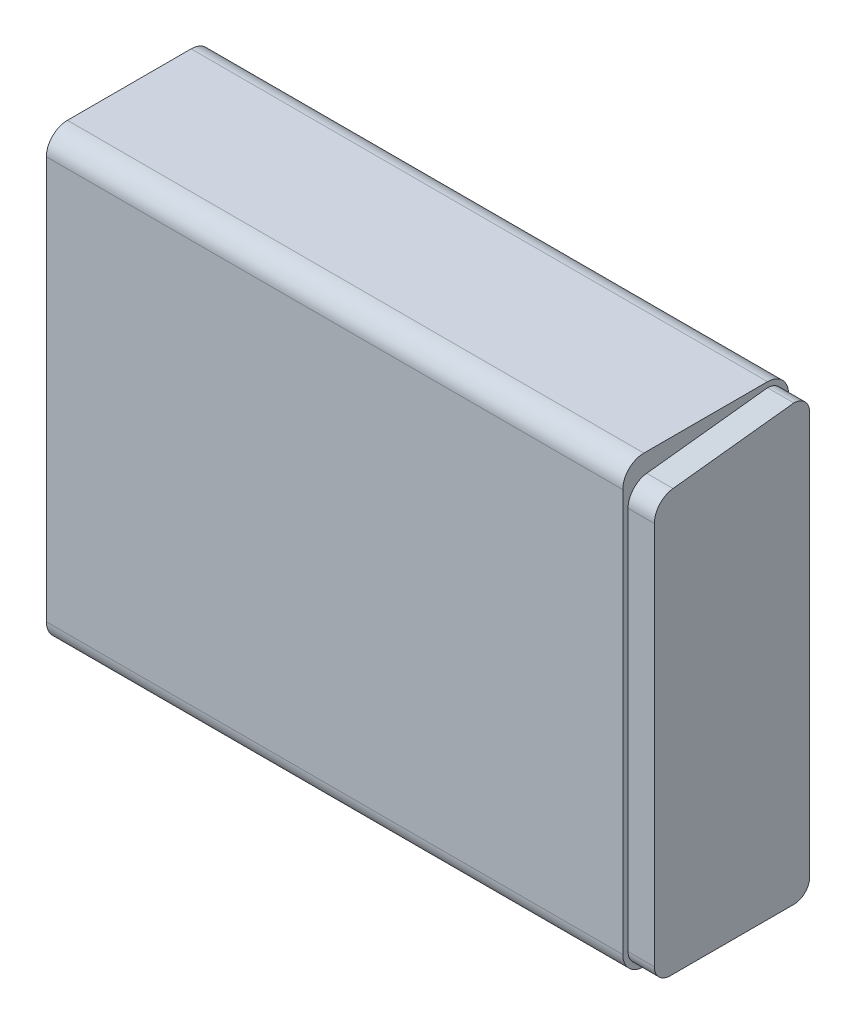
ISO-10303-21;
HEADER;
FILE_DESCRIPTION(('STEP AP214'),'2;1');
FILE_NAME('part.step','',(''),(''),'','','');
FILE_SCHEMA(('AUTOMOTIVE_DESIGN { 1 0 10303 214 1 1 1 1 }'));
ENDSEC;
DATA;
#1=APPLICATION_CONTEXT('core data for automotive mechanical design processes');
#2=APPLICATION_PROTOCOL_DEFINITION('international standard','automotive_design',2000,#1);
#3=PRODUCT_CONTEXT('',#1,'mechanical');
#4=PRODUCT('Part','Part','',(#3));
#5=PRODUCT_RELATED_PRODUCT_CATEGORY('part','',(#4));
#6=PRODUCT_DEFINITION_FORMATION('','',#4);
#7=PRODUCT_DEFINITION_CONTEXT('part definition',#1,'design');
#8=PRODUCT_DEFINITION('design','',#6,#7);
#9=PRODUCT_DEFINITION_SHAPE('','',#8);
#10=(LENGTH_UNIT() NAMED_UNIT(*) SI_UNIT(.MILLI.,.METRE.));
#11=(NAMED_UNIT(*) PLANE_ANGLE_UNIT() SI_UNIT($,.RADIAN.));
#12=(NAMED_UNIT(*) SI_UNIT($,.STERADIAN.) SOLID_ANGLE_UNIT());
#13=UNCERTAINTY_MEASURE_WITH_UNIT(LENGTH_MEASURE(1.E-05),#10,'distance_accuracy_value','');
#14=(GEOMETRIC_REPRESENTATION_CONTEXT(3) GLOBAL_UNCERTAINTY_ASSIGNED_CONTEXT((#13)) GLOBAL_UNIT_ASSIGNED_CONTEXT((#10,
#11,#12)) REPRESENTATION_CONTEXT('',''));
#15=CARTESIAN_POINT('',(0.,0.,0.));
#16=DIRECTION('',(0.,0.,1.));
#17=DIRECTION('',(1.,0.,0.));
#18=AXIS2_PLACEMENT_3D('',#15,#16,#17);
#19=CARTESIAN_POINT('',(0.,255.5875,-12.7));
#20=DIRECTION('',(1.,0.,0.));
#21=DIRECTION('',(0.,0.,-1.));
#22=AXIS2_PLACEMENT_3D('',#19,#20,#21);
#23=PLANE('',#22);
#24=CARTESIAN_POINT('',(0.,255.5875,-12.7));
#25=DIRECTION('',(1.,0.,0.));
#26=DIRECTION('',(0.,0.,-1.));
#27=AXIS2_PLACEMENT_3D('',#24,#25,#26);
#28=CIRCLE('',#27,12.7);
#29=CARTESIAN_POINT('',(0.,268.2875,-12.7000000000001));
#30=VERTEX_POINT('',#29);
#31=CARTESIAN_POINT('',(0.,255.5875,0.));
#32=VERTEX_POINT('',#31);
#33=EDGE_CURVE('E144',#30,#32,#28,.T.);
#34=ORIENTED_EDGE('',*,*,#33,.T.);
#35=DIRECTION('',(0.,-1.,0.));
#36=VECTOR('',#35,1.);
#37=CARTESIAN_POINT('',(0.,12.7000000000001,0.));
#38=LINE('',#37,#36);
#39=CARTESIAN_POINT('',(0.,12.7000000000001,0.));
#40=VERTEX_POINT('',#39);
#41=EDGE_CURVE('E147',#32,#40,#38,.T.);
#42=ORIENTED_EDGE('',*,*,#41,.T.);
#43=CARTESIAN_POINT('',(0.,12.7,-12.7));
#44=DIRECTION('',(1.,0.,0.));
#45=DIRECTION('',(0.,0.,-1.));
#46=AXIS2_PLACEMENT_3D('',#43,#44,#45);
#47=CIRCLE('',#46,12.7);
#48=CARTESIAN_POINT('',(0.,0.,-12.7000000000001));
#49=VERTEX_POINT('',#48);
#50=EDGE_CURVE('E151',#40,#49,#47,.T.);
#51=ORIENTED_EDGE('',*,*,#50,.T.);
#52=DIRECTION('',(0.,0.,-1.));
#53=VECTOR('',#52,1.);
#54=CARTESIAN_POINT('',(0.,0.,-12.7000000000001));
#55=LINE('',#54,#53);
#56=CARTESIAN_POINT('',(0.,0.,-87.3124999999999));
#57=VERTEX_POINT('',#56);
#58=EDGE_CURVE('E154',#49,#57,#55,.T.);
#59=ORIENTED_EDGE('',*,*,#58,.T.);
#60=CARTESIAN_POINT('',(0.,12.7,-87.3125));
#61=DIRECTION('',(1.,0.,0.));
#62=DIRECTION('',(0.,0.,1.));
#63=AXIS2_PLACEMENT_3D('',#60,#61,#62);
#64=CIRCLE('',#63,12.7);
#65=CARTESIAN_POINT('',(0.,12.7000000000001,-100.0125));
#66=VERTEX_POINT('',#65);
#67=EDGE_CURVE('E157',#57,#66,#64,.T.);
#68=ORIENTED_EDGE('',*,*,#67,.T.);
#69=DIRECTION('',(0.,1.,0.));
#70=VECTOR('',#69,1.);
#71=CARTESIAN_POINT('',(0.,12.7000000000001,-100.0125));
#72=LINE('',#71,#70);
#73=CARTESIAN_POINT('',(0.,255.5875,-100.0125));
#74=VERTEX_POINT('',#73);
#75=EDGE_CURVE('E160',#66,#74,#72,.T.);
#76=ORIENTED_EDGE('',*,*,#75,.T.);
#77=CARTESIAN_POINT('',(0.,255.5875,-87.3125));
#78=DIRECTION('',(1.,0.,0.));
#79=DIRECTION('',(0.,0.,-1.));
#80=AXIS2_PLACEMENT_3D('',#77,#78,#79);
#81=CIRCLE('',#80,12.7);
#82=CARTESIAN_POINT('',(0.,268.2875,-87.3124999999999));
#83=VERTEX_POINT('',#82);
#84=EDGE_CURVE('E121',#74,#83,#81,.T.);
#85=ORIENTED_EDGE('',*,*,#84,.T.);
#86=DIRECTION('',(0.,0.,1.));
#87=VECTOR('',#86,1.);
#88=CARTESIAN_POINT('',(0.,268.2875,-12.7000000000001));
#89=LINE('',#88,#87);
#90=EDGE_CURVE('E163',#83,#30,#89,.T.);
#91=ORIENTED_EDGE('',*,*,#90,.T.);
#92=EDGE_LOOP('',(#34,#42,#51,#59,#68,#76,#85,#91));
#93=FACE_BOUND('',#92,.T.);
#94=DIRECTION('',(0.,-1.,0.));
#95=VECTOR('',#94,1.);
#96=CARTESIAN_POINT('',(0.,244.244113661562,-3.175));
#97=LINE('',#96,#95);
#98=CARTESIAN_POINT('',(0.,244.244113661562,-3.175));
#99=VERTEX_POINT('',#98);
#100=CARTESIAN_POINT('',(0.,12.7000000000001,-3.175));
#101=VERTEX_POINT('',#100);
#102=EDGE_CURVE('E423',#99,#101,#97,.T.);
#103=ORIENTED_EDGE('',*,*,#102,.F.);
#104=CARTESIAN_POINT('',(0.,244.244113661562,-15.875));
#105=DIRECTION('',(1.,0.,0.));
#106=DIRECTION('',(0.,0.,1.));
#107=AXIS2_PLACEMENT_3D('',#104,#105,#106);
#108=CIRCLE('',#107,12.7);
#109=CARTESIAN_POINT('',(0.,256.863506359162,-14.4463895059322));
#110=VERTEX_POINT('',#109);
#111=EDGE_CURVE('E251',#110,#99,#108,.T.);
#112=ORIENTED_EDGE('',*,*,#111,.F.);
#113=DIRECTION('',(0.,-0.112489015280939,0.993652968314957));
#114=VECTOR('',#113,1.);
#115=CARTESIAN_POINT('',(0.,256.863506359162,-14.4463895059322));
#116=LINE('',#115,#114);
#117=CARTESIAN_POINT('',(0.,265.1125,-87.3124999999999));
#118=VERTEX_POINT('',#117);
#119=EDGE_CURVE('E245',#118,#110,#116,.T.);
#120=ORIENTED_EDGE('',*,*,#119,.F.);
#121=CARTESIAN_POINT('',(0.,255.5875,-87.3125));
#122=DIRECTION('',(1.,0.,0.));
#123=DIRECTION('',(0.,0.,-1.));
#124=AXIS2_PLACEMENT_3D('',#121,#122,#123);
#125=CIRCLE('',#124,9.52500000000001);
#126=CARTESIAN_POINT('',(0.,255.5875,-96.8375));
#127=VERTEX_POINT('',#126);
#128=EDGE_CURVE('E409',#127,#118,#125,.T.);
#129=ORIENTED_EDGE('',*,*,#128,.F.);
#130=DIRECTION('',(0.,1.,0.));
#131=VECTOR('',#130,1.);
#132=CARTESIAN_POINT('',(0.,12.7000000000001,-96.8375));
#133=LINE('',#132,#131);
#134=CARTESIAN_POINT('',(0.,12.7,-96.8375));
#135=VERTEX_POINT('',#134);
#136=EDGE_CURVE('E411',#135,#127,#133,.T.);
#137=ORIENTED_EDGE('',*,*,#136,.F.);
#138=CARTESIAN_POINT('',(0.,12.7,-87.3125));
#139=DIRECTION('',(1.,0.,0.));
#140=DIRECTION('',(0.,0.,-1.));
#141=AXIS2_PLACEMENT_3D('',#138,#139,#140);
#142=CIRCLE('',#141,9.525);
#143=CARTESIAN_POINT('',(0.,3.175,-87.3124999999999));
#144=VERTEX_POINT('',#143);
#145=EDGE_CURVE('E414',#144,#135,#142,.T.);
#146=ORIENTED_EDGE('',*,*,#145,.F.);
#147=DIRECTION('',(0.,0.,-1.));
#148=VECTOR('',#147,1.);
#149=CARTESIAN_POINT('',(0.,3.175,-12.7000000000001));
#150=LINE('',#149,#148);
#151=CARTESIAN_POINT('',(0.,3.175,-12.7000000000001));
#152=VERTEX_POINT('',#151);
#153=EDGE_CURVE('E417',#152,#144,#150,.T.);
#154=ORIENTED_EDGE('',*,*,#153,.F.);
#155=CARTESIAN_POINT('',(0.,12.7,-12.7));
#156=DIRECTION('',(1.,0.,0.));
#157=DIRECTION('',(0.,0.,-1.));
#158=AXIS2_PLACEMENT_3D('',#155,#156,#157);
#159=CIRCLE('',#158,9.525);
#160=EDGE_CURVE('E420',#101,#152,#159,.T.);
#161=ORIENTED_EDGE('',*,*,#160,.F.);
#162=EDGE_LOOP('',(#103,#112,#120,#129,#137,#146,#154,#161));
#163=FACE_BOUND('',#162,.T.);
#164=ADVANCED_FACE('F33',(#93,#163),#23,.T.);
#165=CARTESIAN_POINT('',(-347.6625,255.5875,-12.7));
#166=DIRECTION('',(1.,0.,0.));
#167=DIRECTION('',(0.,0.,-1.));
#168=AXIS2_PLACEMENT_3D('',#165,#166,#167);
#169=CYLINDRICAL_SURFACE('',#168,12.7);
#170=ORIENTED_EDGE('',*,*,#33,.F.);
#171=DIRECTION('',(1.,0.,0.));
#172=VECTOR('',#171,1.);
#173=CARTESIAN_POINT('',(-347.6625,268.2875,-12.7000000000001));
#174=LINE('',#173,#172);
#175=CARTESIAN_POINT('',(-347.6625,268.2875,-12.7000000000001));
#176=VERTEX_POINT('',#175);
#177=EDGE_CURVE('E11',#176,#30,#174,.T.);
#178=ORIENTED_EDGE('',*,*,#177,.F.);
#179=CARTESIAN_POINT('',(-347.6625,255.5875,-12.7));
#180=DIRECTION('',(1.,0.,0.));
#181=DIRECTION('',(0.,0.,-1.));
#182=AXIS2_PLACEMENT_3D('',#179,#180,#181);
#183=CIRCLE('',#182,12.7);
#184=CARTESIAN_POINT('',(-347.6625,255.5875,0.));
#185=VERTEX_POINT('',#184);
#186=EDGE_CURVE('E165',#176,#185,#183,.T.);
#187=ORIENTED_EDGE('',*,*,#186,.T.);
#188=DIRECTION('',(1.,0.,0.));
#189=VECTOR('',#188,1.);
#190=CARTESIAN_POINT('',(-347.6625,255.5875,0.));
#191=LINE('',#190,#189);
#192=EDGE_CURVE('E37',#185,#32,#191,.T.);
#193=ORIENTED_EDGE('',*,*,#192,.T.);
#194=EDGE_LOOP('',(#170,#178,#187,#193));
#195=FACE_BOUND('',#194,.T.);
#196=ADVANCED_FACE('F35',(#195),#169,.T.);
#197=CARTESIAN_POINT('',(-347.6625,268.2875,-12.7000000000001));
#198=DIRECTION('',(0.,1.,0.));
#199=DIRECTION('',(0.,0.,1.));
#200=AXIS2_PLACEMENT_3D('',#197,#198,#199);
#201=PLANE('',#200);
#202=ORIENTED_EDGE('',*,*,#90,.F.);
#203=DIRECTION('',(1.,0.,0.));
#204=VECTOR('',#203,1.);
#205=CARTESIAN_POINT('',(-347.6625,268.2875,-87.3124999999999));
#206=LINE('',#205,#204);
#207=CARTESIAN_POINT('',(-347.6625,268.2875,-87.3124999999999));
#208=VERTEX_POINT('',#207);
#209=EDGE_CURVE('E42',#208,#83,#206,.T.);
#210=ORIENTED_EDGE('',*,*,#209,.F.);
#211=DIRECTION('',(0.,0.,1.));
#212=VECTOR('',#211,1.);
#213=CARTESIAN_POINT('',(-347.6625,268.2875,-12.7000000000001));
#214=LINE('',#213,#212);
#215=EDGE_CURVE('E134',#208,#176,#214,.T.);
#216=ORIENTED_EDGE('',*,*,#215,.T.);
#217=ORIENTED_EDGE('',*,*,#177,.T.);
#218=EDGE_LOOP('',(#202,#210,#216,#217));
#219=FACE_BOUND('',#218,.T.);
#220=ADVANCED_FACE('F177',(#219),#201,.T.);
#221=CARTESIAN_POINT('',(-347.6625,255.5875,-87.3125));
#222=DIRECTION('',(1.,0.,0.));
#223=DIRECTION('',(0.,0.,-1.));
#224=AXIS2_PLACEMENT_3D('',#221,#222,#223);
#225=CYLINDRICAL_SURFACE('',#224,12.7);
#226=ORIENTED_EDGE('',*,*,#84,.F.);
#227=DIRECTION('',(1.,0.,0.));
#228=VECTOR('',#227,1.);
#229=CARTESIAN_POINT('',(-347.6625,255.5875,-100.0125));
#230=LINE('',#229,#228);
#231=CARTESIAN_POINT('',(-347.6625,255.5875,-100.0125));
#232=VERTEX_POINT('',#231);
#233=EDGE_CURVE('E115',#232,#74,#230,.T.);
#234=ORIENTED_EDGE('',*,*,#233,.F.);
#235=CARTESIAN_POINT('',(-347.6625,255.5875,-87.3125));
#236=DIRECTION('',(1.,0.,0.));
#237=DIRECTION('',(0.,0.,-1.));
#238=AXIS2_PLACEMENT_3D('',#235,#236,#237);
#239=CIRCLE('',#238,12.7);
#240=EDGE_CURVE('E118',#232,#208,#239,.T.);
#241=ORIENTED_EDGE('',*,*,#240,.T.);
#242=ORIENTED_EDGE('',*,*,#209,.T.);
#243=EDGE_LOOP('',(#226,#234,#241,#242));
#244=FACE_BOUND('',#243,.T.);
#245=ADVANCED_FACE('F117',(#244),#225,.T.);
#246=CARTESIAN_POINT('',(-347.6625,12.7000000000001,-100.0125));
#247=DIRECTION('',(0.,0.,-1.));
#248=DIRECTION('',(-1.,0.,0.));
#249=AXIS2_PLACEMENT_3D('',#246,#247,#248);
#250=PLANE('',#249);
#251=ORIENTED_EDGE('',*,*,#75,.F.);
#252=DIRECTION('',(1.,0.,0.));
#253=VECTOR('',#252,1.);
#254=CARTESIAN_POINT('',(-347.6625,12.7000000000001,-100.0125));
#255=LINE('',#254,#253);
#256=CARTESIAN_POINT('',(-347.6625,12.7000000000001,-100.0125));
#257=VERTEX_POINT('',#256);
#258=EDGE_CURVE('E126',#257,#66,#255,.T.);
#259=ORIENTED_EDGE('',*,*,#258,.F.);
#260=DIRECTION('',(0.,1.,0.));
#261=VECTOR('',#260,1.);
#262=CARTESIAN_POINT('',(-347.6625,12.7000000000001,-100.0125));
#263=LINE('',#262,#261);
#264=EDGE_CURVE('E132',#257,#232,#263,.T.);
#265=ORIENTED_EDGE('',*,*,#264,.T.);
#266=ORIENTED_EDGE('',*,*,#233,.T.);
#267=EDGE_LOOP('',(#251,#259,#265,#266));
#268=FACE_BOUND('',#267,.T.);
#269=ADVANCED_FACE('F136',(#268),#250,.T.);
#270=CARTESIAN_POINT('',(-347.6625,12.7,-87.3125));
#271=DIRECTION('',(1.,0.,0.));
#272=DIRECTION('',(0.,0.,-1.));
#273=AXIS2_PLACEMENT_3D('',#270,#271,#272);
#274=CYLINDRICAL_SURFACE('',#273,12.7);
#275=ORIENTED_EDGE('',*,*,#67,.F.);
#276=DIRECTION('',(1.,0.,0.));
#277=VECTOR('',#276,1.);
#278=CARTESIAN_POINT('',(-347.6625,0.,-87.3124999999999));
#279=LINE('',#278,#277);
#280=CARTESIAN_POINT('',(-347.6625,0.,-87.3124999999999));
#281=VERTEX_POINT('',#280);
#282=EDGE_CURVE('E169',#281,#57,#279,.T.);
#283=ORIENTED_EDGE('',*,*,#282,.F.);
#284=CARTESIAN_POINT('',(-347.6625,12.7,-87.3125));
#285=DIRECTION('',(1.,0.,0.));
#286=DIRECTION('',(0.,0.,1.));
#287=AXIS2_PLACEMENT_3D('',#284,#285,#286);
#288=CIRCLE('',#287,12.7);
#289=EDGE_CURVE('E137',#281,#257,#288,.T.);
#290=ORIENTED_EDGE('',*,*,#289,.T.);
#291=ORIENTED_EDGE('',*,*,#258,.T.);
#292=EDGE_LOOP('',(#275,#283,#290,#291));
#293=FACE_BOUND('',#292,.T.);
#294=ADVANCED_FACE('F276',(#293),#274,.T.);
#295=CARTESIAN_POINT('',(-347.6625,0.,-12.7000000000001));
#296=DIRECTION('',(0.,-1.,0.));
#297=DIRECTION('',(0.,0.,-1.));
#298=AXIS2_PLACEMENT_3D('',#295,#296,#297);
#299=PLANE('',#298);
#300=ORIENTED_EDGE('',*,*,#58,.F.);
#301=DIRECTION('',(1.,0.,0.));
#302=VECTOR('',#301,1.);
#303=CARTESIAN_POINT('',(-347.6625,0.,-12.7000000000001));
#304=LINE('',#303,#302);
#305=CARTESIAN_POINT('',(-347.6625,0.,-12.7000000000001));
#306=VERTEX_POINT('',#305);
#307=EDGE_CURVE('E171',#306,#49,#304,.T.);
#308=ORIENTED_EDGE('',*,*,#307,.F.);
#309=DIRECTION('',(0.,0.,-1.));
#310=VECTOR('',#309,1.);
#311=CARTESIAN_POINT('',(-347.6625,0.,-12.7000000000001));
#312=LINE('',#311,#310);
#313=EDGE_CURVE('E139',#306,#281,#312,.T.);
#314=ORIENTED_EDGE('',*,*,#313,.T.);
#315=ORIENTED_EDGE('',*,*,#282,.T.);
#316=EDGE_LOOP('',(#300,#308,#314,#315));
#317=FACE_BOUND('',#316,.T.);
#318=ADVANCED_FACE('F270',(#317),#299,.T.);
#319=CARTESIAN_POINT('',(-347.6625,12.7,-12.7));
#320=DIRECTION('',(1.,0.,0.));
#321=DIRECTION('',(0.,0.,-1.));
#322=AXIS2_PLACEMENT_3D('',#319,#320,#321);
#323=CYLINDRICAL_SURFACE('',#322,12.7);
#324=ORIENTED_EDGE('',*,*,#50,.F.);
#325=DIRECTION('',(1.,0.,0.));
#326=VECTOR('',#325,1.);
#327=CARTESIAN_POINT('',(-347.6625,12.7000000000001,0.));
#328=LINE('',#327,#326);
#329=CARTESIAN_POINT('',(-347.6625,12.7000000000001,0.));
#330=VERTEX_POINT('',#329);
#331=EDGE_CURVE('E172',#330,#40,#328,.T.);
#332=ORIENTED_EDGE('',*,*,#331,.F.);
#333=CARTESIAN_POINT('',(-347.6625,12.7,-12.7));
#334=DIRECTION('',(1.,0.,0.));
#335=DIRECTION('',(0.,0.,-1.));
#336=AXIS2_PLACEMENT_3D('',#333,#334,#335);
#337=CIRCLE('',#336,12.7);
#338=EDGE_CURVE('E264',#330,#306,#337,.T.);
#339=ORIENTED_EDGE('',*,*,#338,.T.);
#340=ORIENTED_EDGE('',*,*,#307,.T.);
#341=EDGE_LOOP('',(#324,#332,#339,#340));
#342=FACE_BOUND('',#341,.T.);
#343=ADVANCED_FACE('F274',(#342),#323,.T.);
#344=CARTESIAN_POINT('',(-347.6625,12.7000000000001,0.));
#345=DIRECTION('',(0.,0.,1.));
#346=DIRECTION('',(1.,0.,0.));
#347=AXIS2_PLACEMENT_3D('',#344,#345,#346);
#348=PLANE('',#347);
#349=ORIENTED_EDGE('',*,*,#41,.F.);
#350=ORIENTED_EDGE('',*,*,#192,.F.);
#351=DIRECTION('',(0.,-1.,0.));
#352=VECTOR('',#351,1.);
#353=CARTESIAN_POINT('',(-347.6625,12.7000000000001,0.));
#354=LINE('',#353,#352);
#355=EDGE_CURVE('E262',#185,#330,#354,.T.);
#356=ORIENTED_EDGE('',*,*,#355,.T.);
#357=ORIENTED_EDGE('',*,*,#331,.T.);
#358=EDGE_LOOP('',(#349,#350,#356,#357));
#359=FACE_BOUND('',#358,.T.);
#360=ADVANCED_FACE('F174',(#359),#348,.T.);
#361=CARTESIAN_POINT('',(-347.6625,255.5875,-12.7));
#362=DIRECTION('',(1.,0.,0.));
#363=DIRECTION('',(0.,0.,-1.));
#364=AXIS2_PLACEMENT_3D('',#361,#362,#363);
#365=PLANE('',#364);
#366=ORIENTED_EDGE('',*,*,#186,.F.);
#367=ORIENTED_EDGE('',*,*,#215,.F.);
#368=ORIENTED_EDGE('',*,*,#240,.F.);
#369=ORIENTED_EDGE('',*,*,#264,.F.);
#370=ORIENTED_EDGE('',*,*,#289,.F.);
#371=ORIENTED_EDGE('',*,*,#313,.F.);
#372=ORIENTED_EDGE('',*,*,#338,.F.);
#373=ORIENTED_EDGE('',*,*,#355,.F.);
#374=EDGE_LOOP('',(#366,#367,#368,#369,#370,#371,#372,#373));
#375=FACE_BOUND('',#374,.T.);
#376=ADVANCED_FACE('F130',(#375),#365,.F.);
#377=CARTESIAN_POINT('',(15.875,244.244113661562,-15.875));
#378=DIRECTION('',(-1.,0.,0.));
#379=DIRECTION('',(0.,0.,1.));
#380=AXIS2_PLACEMENT_3D('',#377,#378,#379);
#381=CYLINDRICAL_SURFACE('',#380,12.7);
#382=ORIENTED_EDGE('',*,*,#111,.T.);
#383=DIRECTION('',(-1.,0.,0.));
#384=VECTOR('',#383,1.);
#385=CARTESIAN_POINT('',(15.875,244.244113661562,-3.175));
#386=LINE('',#385,#384);
#387=CARTESIAN_POINT('',(15.875,244.244113661562,-3.175));
#388=VERTEX_POINT('',#387);
#389=EDGE_CURVE('E148',#388,#99,#386,.T.);
#390=ORIENTED_EDGE('',*,*,#389,.F.);
#391=CARTESIAN_POINT('',(15.875,244.244113661562,-15.875));
#392=DIRECTION('',(1.,0.,0.));
#393=DIRECTION('',(0.,0.,1.));
#394=AXIS2_PLACEMENT_3D('',#391,#392,#393);
#395=CIRCLE('',#394,12.7);
#396=CARTESIAN_POINT('',(15.875,256.863506359162,-14.4463895059322));
#397=VERTEX_POINT('',#396);
#398=EDGE_CURVE('E233',#397,#388,#395,.T.);
#399=ORIENTED_EDGE('',*,*,#398,.F.);
#400=DIRECTION('',(-1.,0.,0.));
#401=VECTOR('',#400,1.);
#402=CARTESIAN_POINT('',(15.875,256.863506359162,-14.4463895059322));
#403=LINE('',#402,#401);
#404=EDGE_CURVE('E406',#397,#110,#403,.T.);
#405=ORIENTED_EDGE('',*,*,#404,.T.);
#406=EDGE_LOOP('',(#382,#390,#399,#405));
#407=FACE_BOUND('',#406,.T.);
#408=ADVANCED_FACE('F192',(#407),#381,.T.);
#409=CARTESIAN_POINT('',(15.875,244.244113661562,-3.175));
#410=DIRECTION('',(0.,0.,-1.));
#411=DIRECTION('',(0.,1.,0.));
#412=AXIS2_PLACEMENT_3D('',#409,#410,#411);
#413=PLANE('',#412);
#414=ORIENTED_EDGE('',*,*,#102,.T.);
#415=DIRECTION('',(-1.,0.,0.));
#416=VECTOR('',#415,1.);
#417=CARTESIAN_POINT('',(15.875,12.7000000000001,-3.175));
#418=LINE('',#417,#416);
#419=CARTESIAN_POINT('',(15.875,12.7000000000001,-3.175));
#420=VERTEX_POINT('',#419);
#421=EDGE_CURVE('E254',#420,#101,#418,.T.);
#422=ORIENTED_EDGE('',*,*,#421,.F.);
#423=DIRECTION('',(0.,-1.,0.));
#424=VECTOR('',#423,1.);
#425=CARTESIAN_POINT('',(15.875,244.244113661562,-3.175));
#426=LINE('',#425,#424);
#427=EDGE_CURVE('E238',#388,#420,#426,.T.);
#428=ORIENTED_EDGE('',*,*,#427,.F.);
#429=ORIENTED_EDGE('',*,*,#389,.T.);
#430=EDGE_LOOP('',(#414,#422,#428,#429));
#431=FACE_BOUND('',#430,.T.);
#432=ADVANCED_FACE('F195',(#431),#413,.F.);
#433=CARTESIAN_POINT('',(15.875,12.7,-12.7));
#434=DIRECTION('',(-1.,0.,0.));
#435=DIRECTION('',(0.,0.,1.));
#436=AXIS2_PLACEMENT_3D('',#433,#434,#435);
#437=CYLINDRICAL_SURFACE('',#436,9.525);
#438=ORIENTED_EDGE('',*,*,#160,.T.);
#439=DIRECTION('',(-1.,0.,0.));
#440=VECTOR('',#439,1.);
#441=CARTESIAN_POINT('',(15.875,3.175,-12.7000000000001));
#442=LINE('',#441,#440);
#443=CARTESIAN_POINT('',(15.875,3.175,-12.7000000000001));
#444=VERTEX_POINT('',#443);
#445=EDGE_CURVE('E257',#444,#152,#442,.T.);
#446=ORIENTED_EDGE('',*,*,#445,.F.);
#447=CARTESIAN_POINT('',(15.875,12.7,-12.7));
#448=DIRECTION('',(1.,0.,0.));
#449=DIRECTION('',(0.,0.,-1.));
#450=AXIS2_PLACEMENT_3D('',#447,#448,#449);
#451=CIRCLE('',#450,9.525);
#452=EDGE_CURVE('E438',#420,#444,#451,.T.);
#453=ORIENTED_EDGE('',*,*,#452,.F.);
#454=ORIENTED_EDGE('',*,*,#421,.T.);
#455=EDGE_LOOP('',(#438,#446,#453,#454));
#456=FACE_BOUND('',#455,.T.);
#457=ADVANCED_FACE('F199',(#456),#437,.T.);
#458=CARTESIAN_POINT('',(15.875,3.175,-12.7000000000001));
#459=DIRECTION('',(0.,1.,0.));
#460=DIRECTION('',(0.,0.,1.));
#461=AXIS2_PLACEMENT_3D('',#458,#459,#460);
#462=PLANE('',#461);
#463=ORIENTED_EDGE('',*,*,#153,.T.);
#464=DIRECTION('',(-1.,0.,0.));
#465=VECTOR('',#464,1.);
#466=CARTESIAN_POINT('',(15.875,3.175,-87.3124999999999));
#467=LINE('',#466,#465);
#468=CARTESIAN_POINT('',(15.875,3.175,-87.3124999999999));
#469=VERTEX_POINT('',#468);
#470=EDGE_CURVE('E396',#469,#144,#467,.T.);
#471=ORIENTED_EDGE('',*,*,#470,.F.);
#472=DIRECTION('',(0.,0.,-1.));
#473=VECTOR('',#472,1.);
#474=CARTESIAN_POINT('',(15.875,3.175,-12.7000000000001));
#475=LINE('',#474,#473);
#476=EDGE_CURVE('E435',#444,#469,#475,.T.);
#477=ORIENTED_EDGE('',*,*,#476,.F.);
#478=ORIENTED_EDGE('',*,*,#445,.T.);
#479=EDGE_LOOP('',(#463,#471,#477,#478));
#480=FACE_BOUND('',#479,.T.);
#481=ADVANCED_FACE('F203',(#480),#462,.F.);
#482=CARTESIAN_POINT('',(15.875,12.7,-87.3125));
#483=DIRECTION('',(-1.,0.,0.));
#484=DIRECTION('',(0.,0.,1.));
#485=AXIS2_PLACEMENT_3D('',#482,#483,#484);
#486=CYLINDRICAL_SURFACE('',#485,9.525);
#487=ORIENTED_EDGE('',*,*,#145,.T.);
#488=DIRECTION('',(-1.,0.,0.));
#489=VECTOR('',#488,1.);
#490=CARTESIAN_POINT('',(15.875,12.7,-96.8375));
#491=LINE('',#490,#489);
#492=CARTESIAN_POINT('',(15.875,12.7,-96.8375));
#493=VERTEX_POINT('',#492);
#494=EDGE_CURVE('E399',#493,#135,#491,.T.);
#495=ORIENTED_EDGE('',*,*,#494,.F.);
#496=CARTESIAN_POINT('',(15.875,12.7,-87.3125));
#497=DIRECTION('',(1.,0.,0.));
#498=DIRECTION('',(0.,0.,-1.));
#499=AXIS2_PLACEMENT_3D('',#496,#497,#498);
#500=CIRCLE('',#499,9.525);
#501=EDGE_CURVE('E432',#469,#493,#500,.T.);
#502=ORIENTED_EDGE('',*,*,#501,.F.);
#503=ORIENTED_EDGE('',*,*,#470,.T.);
#504=EDGE_LOOP('',(#487,#495,#502,#503));
#505=FACE_BOUND('',#504,.T.);
#506=ADVANCED_FACE('F207',(#505),#486,.T.);
#507=CARTESIAN_POINT('',(15.875,12.7000000000001,-96.8375));
#508=DIRECTION('',(0.,0.,1.));
#509=DIRECTION('',(1.,0.,0.));
#510=AXIS2_PLACEMENT_3D('',#507,#508,#509);
#511=PLANE('',#510);
#512=ORIENTED_EDGE('',*,*,#136,.T.);
#513=DIRECTION('',(-1.,0.,0.));
#514=VECTOR('',#513,1.);
#515=CARTESIAN_POINT('',(15.875,255.5875,-96.8375));
#516=LINE('',#515,#514);
#517=CARTESIAN_POINT('',(15.875,255.5875,-96.8375));
#518=VERTEX_POINT('',#517);
#519=EDGE_CURVE('E402',#518,#127,#516,.T.);
#520=ORIENTED_EDGE('',*,*,#519,.F.);
#521=DIRECTION('',(0.,1.,0.));
#522=VECTOR('',#521,1.);
#523=CARTESIAN_POINT('',(15.875,12.7000000000001,-96.8375));
#524=LINE('',#523,#522);
#525=EDGE_CURVE('E429',#493,#518,#524,.T.);
#526=ORIENTED_EDGE('',*,*,#525,.F.);
#527=ORIENTED_EDGE('',*,*,#494,.T.);
#528=EDGE_LOOP('',(#512,#520,#526,#527));
#529=FACE_BOUND('',#528,.T.);
#530=ADVANCED_FACE('F211',(#529),#511,.F.);
#531=CARTESIAN_POINT('',(15.875,255.5875,-87.3125));
#532=DIRECTION('',(-1.,0.,0.));
#533=DIRECTION('',(0.,0.,1.));
#534=AXIS2_PLACEMENT_3D('',#531,#532,#533);
#535=CYLINDRICAL_SURFACE('',#534,9.52500000000001);
#536=ORIENTED_EDGE('',*,*,#128,.T.);
#537=DIRECTION('',(-1.,0.,0.));
#538=VECTOR('',#537,1.);
#539=CARTESIAN_POINT('',(15.875,265.1125,-87.3124999999999));
#540=LINE('',#539,#538);
#541=CARTESIAN_POINT('',(15.875,265.1125,-87.3124999999999));
#542=VERTEX_POINT('',#541);
#543=EDGE_CURVE('E50',#542,#118,#540,.T.);
#544=ORIENTED_EDGE('',*,*,#543,.F.);
#545=CARTESIAN_POINT('',(15.875,255.5875,-87.3125));
#546=DIRECTION('',(1.,0.,0.));
#547=DIRECTION('',(0.,0.,-1.));
#548=AXIS2_PLACEMENT_3D('',#545,#546,#547);
#549=CIRCLE('',#548,9.52500000000001);
#550=EDGE_CURVE('E427',#518,#542,#549,.T.);
#551=ORIENTED_EDGE('',*,*,#550,.F.);
#552=ORIENTED_EDGE('',*,*,#519,.T.);
#553=EDGE_LOOP('',(#536,#544,#551,#552));
#554=FACE_BOUND('',#553,.T.);
#555=ADVANCED_FACE('F215',(#554),#535,.T.);
#556=CARTESIAN_POINT('',(15.875,256.863506359162,-14.4463895059322));
#557=DIRECTION('',(0.,-0.993652968314957,-0.112489015280939));
#558=DIRECTION('',(0.,0.112489015280939,-0.993652968314957));
#559=AXIS2_PLACEMENT_3D('',#556,#557,#558);
#560=PLANE('',#559);
#561=ORIENTED_EDGE('',*,*,#119,.T.);
#562=ORIENTED_EDGE('',*,*,#404,.F.);
#563=DIRECTION('',(0.,-0.112489015280939,0.993652968314957));
#564=VECTOR('',#563,1.);
#565=CARTESIAN_POINT('',(15.875,256.863506359162,-14.4463895059322));
#566=LINE('',#565,#564);
#567=EDGE_CURVE('E241',#542,#397,#566,.T.);
#568=ORIENTED_EDGE('',*,*,#567,.F.);
#569=ORIENTED_EDGE('',*,*,#543,.T.);
#570=EDGE_LOOP('',(#561,#562,#568,#569));
#571=FACE_BOUND('',#570,.T.);
#572=ADVANCED_FACE('F219',(#571),#560,.F.);
#573=CARTESIAN_POINT('',(15.875,244.244113661562,-15.875));
#574=DIRECTION('',(-1.,0.,0.));
#575=DIRECTION('',(0.,0.,1.));
#576=AXIS2_PLACEMENT_3D('',#573,#574,#575);
#577=PLANE('',#576);
#578=ORIENTED_EDGE('',*,*,#398,.T.);
#579=ORIENTED_EDGE('',*,*,#427,.T.);
#580=ORIENTED_EDGE('',*,*,#452,.T.);
#581=ORIENTED_EDGE('',*,*,#476,.T.);
#582=ORIENTED_EDGE('',*,*,#501,.T.);
#583=ORIENTED_EDGE('',*,*,#525,.T.);
#584=ORIENTED_EDGE('',*,*,#550,.T.);
#585=ORIENTED_EDGE('',*,*,#567,.T.);
#586=EDGE_LOOP('',(#578,#579,#580,#581,#582,#583,#584,#585));
#587=FACE_BOUND('',#586,.T.);
#588=ADVANCED_FACE('F223',(#587),#577,.F.);
#589=CLOSED_SHELL('',(#164,#196,#220,#245,#269,#294,#318,#343,#360,#376,#408,#432,#457,#481,
#506,#530,#555,#572,#588));
#590=MANIFOLD_SOLID_BREP('B2',#589);
#591=ADVANCED_BREP_SHAPE_REPRESENTATION('',(#18,#590),#14);
#592=SHAPE_DEFINITION_REPRESENTATION(#9,#591);
ENDSEC;
END-ISO-10303-21;
